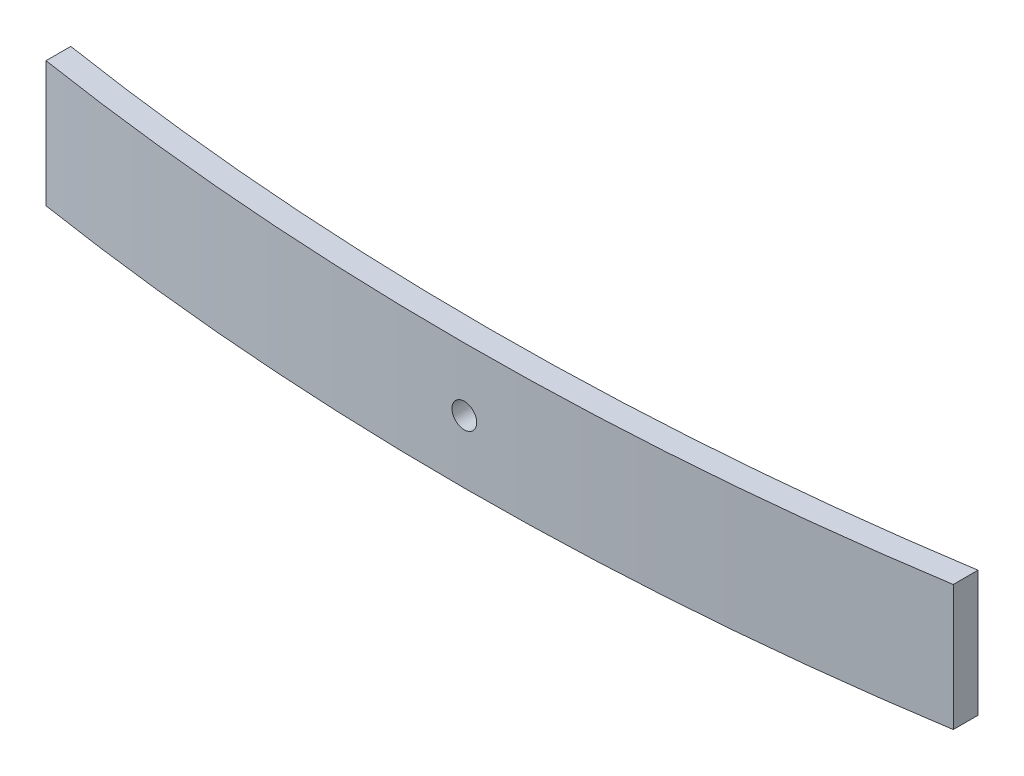
ISO-10303-21;
HEADER;
FILE_DESCRIPTION(('STEP AP214'),'2;1');
FILE_NAME('part.step','',(''),(''),'','','');
FILE_SCHEMA(('AUTOMOTIVE_DESIGN { 1 0 10303 214 1 1 1 1 }'));
ENDSEC;
DATA;
#1=APPLICATION_CONTEXT('core data for automotive mechanical design processes');
#2=APPLICATION_PROTOCOL_DEFINITION('international standard','automotive_design',2000,#1);
#3=PRODUCT_CONTEXT('',#1,'mechanical');
#4=PRODUCT('Part','Part','',(#3));
#5=PRODUCT_RELATED_PRODUCT_CATEGORY('part','',(#4));
#6=PRODUCT_DEFINITION_FORMATION('','',#4);
#7=PRODUCT_DEFINITION_CONTEXT('part definition',#1,'design');
#8=PRODUCT_DEFINITION('design','',#6,#7);
#9=PRODUCT_DEFINITION_SHAPE('','',#8);
#10=(LENGTH_UNIT() NAMED_UNIT(*) SI_UNIT(.MILLI.,.METRE.));
#11=(NAMED_UNIT(*) PLANE_ANGLE_UNIT() SI_UNIT($,.RADIAN.));
#12=(NAMED_UNIT(*) SI_UNIT($,.STERADIAN.) SOLID_ANGLE_UNIT());
#13=UNCERTAINTY_MEASURE_WITH_UNIT(LENGTH_MEASURE(1.E-05),#10,'distance_accuracy_value','');
#14=(GEOMETRIC_REPRESENTATION_CONTEXT(3) GLOBAL_UNCERTAINTY_ASSIGNED_CONTEXT((#13)) GLOBAL_UNIT_ASSIGNED_CONTEXT((#10,
#11,#12)) REPRESENTATION_CONTEXT('',''));
#15=CARTESIAN_POINT('',(0.,0.,0.));
#16=DIRECTION('',(0.,0.,1.));
#17=DIRECTION('',(1.,0.,0.));
#18=AXIS2_PLACEMENT_3D('',#15,#16,#17);
#19=CARTESIAN_POINT('',(1.39133536110259E-13,76.2,-1523.04997748715));
#20=DIRECTION('',(0.,-1.,0.));
#21=DIRECTION('',(0.,0.,-1.));
#22=AXIS2_PLACEMENT_3D('',#19,#20,#21);
#23=CYLINDRICAL_SURFACE('',#22,1776.04997748715);
#24=CARTESIAN_POINT('',(1.39133536110259E-13,0.,-1523.04997748715));
#25=DIRECTION('',(0.,1.,0.));
#26=DIRECTION('',(0.,0.,1.));
#27=AXIS2_PLACEMENT_3D('',#24,#25,#26);
#28=CIRCLE('',#27,1776.04997748715);
#29=CARTESIAN_POINT('',(275.021699517166,0.,231.577215772659));
#30=VERTEX_POINT('',#29);
#31=CARTESIAN_POINT('',(-275.021699517165,0.,231.57721577266));
#32=VERTEX_POINT('',#31);
#33=EDGE_CURVE('E122',#30,#32,#28,.F.);
#34=ORIENTED_EDGE('',*,*,#33,.F.);
#35=DIRECTION('',(0.,-1.,0.));
#36=VECTOR('',#35,1.);
#37=CARTESIAN_POINT('',(275.021699517166,76.2,231.577215772659));
#38=LINE('',#37,#36);
#39=CARTESIAN_POINT('',(275.021699517166,76.2,231.577215772659));
#40=VERTEX_POINT('',#39);
#41=EDGE_CURVE('E11',#40,#30,#38,.T.);
#42=ORIENTED_EDGE('',*,*,#41,.F.);
#43=CARTESIAN_POINT('',(1.39133536110259E-13,76.2,-1523.04997748715));
#44=DIRECTION('',(0.,1.,0.));
#45=DIRECTION('',(0.,0.,1.));
#46=AXIS2_PLACEMENT_3D('',#43,#44,#45);
#47=CIRCLE('',#46,1776.04997748715);
#48=CARTESIAN_POINT('',(-275.021699517165,76.2,231.57721577266));
#49=VERTEX_POINT('',#48);
#50=EDGE_CURVE('E115',#40,#49,#47,.F.);
#51=ORIENTED_EDGE('',*,*,#50,.T.);
#52=DIRECTION('',(0.,-1.,0.));
#53=VECTOR('',#52,1.);
#54=CARTESIAN_POINT('',(-275.021699517165,76.2,231.57721577266));
#55=LINE('',#54,#53);
#56=EDGE_CURVE('E94',#49,#32,#55,.T.);
#57=ORIENTED_EDGE('',*,*,#56,.T.);
#58=EDGE_LOOP('',(#34,#42,#51,#57));
#59=FACE_BOUND('',#58,.T.);
#60=CARTESIAN_POINT('',(1.39133536110259E-13,30.6,253.));
#61=CARTESIAN_POINT('',(-0.210713968094779,30.5999984867718,253.000000017793));
#62=CARTESIAN_POINT('',(-0.421403110930859,30.6088837241473,252.999962421728));
#63=CARTESIAN_POINT('',(-0.841354181845625,30.6443626478279,252.999813125687));
#64=CARTESIAN_POINT('',(-1.05061571988427,30.6709609920997,252.999701406219));
#65=CARTESIAN_POINT('',(-1.46633777348706,30.7417152082758,252.999406859924));
#66=CARTESIAN_POINT('',(-1.67279562512373,30.7858867143383,252.999223969782));
#67=CARTESIAN_POINT('',(-2.08132982906183,30.8914915499317,252.998792209094));
#68=CARTESIAN_POINT('',(-2.28340455125407,30.9529311869032,252.99854331444));
#69=CARTESIAN_POINT('',(-2.68152110119553,31.0925814227028,252.997986836868));
#70=CARTESIAN_POINT('',(-2.87756687230419,31.1707807807116,252.997679293301));
#71=CARTESIAN_POINT('',(-3.26237590887551,31.3434199132982,252.997014137911));
#72=CARTESIAN_POINT('',(-3.45113906456135,31.4378599325678,252.996656525334));
#73=CARTESIAN_POINT('',(-3.8199878049602,31.6422805388219,252.995901490769));
#74=CARTESIAN_POINT('',(-4.00007570143521,31.7522569546406,252.995504079474));
#75=CARTESIAN_POINT('',(-4.35035222525643,31.9869905222912,252.994680636078));
#76=CARTESIAN_POINT('',(-4.52054062300152,32.1117480167399,252.994254603313));
#77=CARTESIAN_POINT('',(-4.84979170206723,32.3751451316169,252.993386048449));
#78=CARTESIAN_POINT('',(-5.00885520931108,32.5137837196365,252.992943527577));
#79=CARTESIAN_POINT('',(-5.31479308067827,32.8040158599574,252.992054369382));
#80=CARTESIAN_POINT('',(-5.4616632047594,32.9556138817971,252.991607730686));
#81=CARTESIAN_POINT('',(-5.74206362701642,33.2705952098567,252.990723311728));
#82=CARTESIAN_POINT('',(-5.87559815641371,33.4339747494301,252.990285528692));
#83=CARTESIAN_POINT('',(-6.12847828337048,33.771463069239,252.989430939818));
#84=CARTESIAN_POINT('',(-6.24781862373922,33.9455757887633,252.989014141786));
#85=CARTESIAN_POINT('',(-6.47138111476852,34.3032005309573,252.988213616074));
#86=CARTESIAN_POINT('',(-6.57560639321551,34.4867105983519,252.987829881559));
#87=CARTESIAN_POINT('',(-6.76822875919972,34.8618615632207,252.98710627353));
#88=CARTESIAN_POINT('',(-6.85662560065947,35.053502587046,252.986766400699));
#89=CARTESIAN_POINT('',(-7.01695887812284,35.443546097178,252.986140178145));
#90=CARTESIAN_POINT('',(-7.08889566823635,35.641948437921,252.98585382727));
#91=CARTESIAN_POINT('',(-7.21580133308614,36.0441127387919,252.985342762279));
#92=CARTESIAN_POINT('',(-7.27076981084061,36.2478748241927,252.985118049605));
#93=CARTESIAN_POINT('',(-7.36333699178478,36.659266525497,252.984736685148));
#94=CARTESIAN_POINT('',(-7.40093897454985,36.8668954034653,252.984580020515));
#95=CARTESIAN_POINT('',(-7.45853120590771,37.2846549482945,252.984339094535));
#96=CARTESIAN_POINT('',(-7.47851535225071,37.4947864564643,252.984254858275));
#97=CARTESIAN_POINT('',(-7.50070359679291,37.9159102543572,252.984161289859));
#98=CARTESIAN_POINT('',(-7.50291408330494,38.1269022075304,252.98415193079));
#99=CARTESIAN_POINT('',(-7.48955360463755,38.5484004665782,252.984208322118));
#100=CARTESIAN_POINT('',(-7.47397607404443,38.7589065643844,252.984274100248));
#101=CARTESIAN_POINT('',(-7.42514452560689,39.1778160268164,252.984478922777));
#102=CARTESIAN_POINT('',(-7.39189401428338,39.386219800212,252.984617952642));
#103=CARTESIAN_POINT('',(-7.30795445093886,39.7994886750944,252.984965325868));
#104=CARTESIAN_POINT('',(-7.25726512758627,40.00435372147,252.985173670308));
#105=CARTESIAN_POINT('',(-7.13880941808651,40.4090816554473,252.985653753506));
#106=CARTESIAN_POINT('',(-7.07104334628323,40.6089446350512,252.985925491099));
#107=CARTESIAN_POINT('',(-6.91891409978093,41.0022558470402,252.986524655178));
#108=CARTESIAN_POINT('',(-6.83455053674627,41.1957039292107,252.986852082966));
#109=CARTESIAN_POINT('',(-6.64984230973388,41.5747716673122,252.987553267696));
#110=CARTESIAN_POINT('',(-6.54950055498256,41.7603927405778,252.9879270162));
#111=CARTESIAN_POINT('',(-6.33350673998434,42.1225834438659,252.988710406047));
#112=CARTESIAN_POINT('',(-6.2178493908565,42.2991499177425,252.989120059772));
#113=CARTESIAN_POINT('',(-5.97209494733969,42.6418601532707,252.98996341449));
#114=CARTESIAN_POINT('',(-5.84200303653208,42.8080076231484,252.990397106822));
#115=CARTESIAN_POINT('',(-5.56830511634727,43.1287715124287,252.991276344151));
#116=CARTESIAN_POINT('',(-5.42469413510149,43.2833836517498,252.991721893463));
#117=CARTESIAN_POINT('',(-4.97502421482192,43.7281685004763,252.993057195178));
#118=CARTESIAN_POINT('',(-4.6498630595049,43.9996590137956,252.993946551662));
#119=CARTESIAN_POINT('',(-4.13197567971227,44.3627081259288,252.995201923407));
#120=CARTESIAN_POINT('',(-3.95423770702111,44.4764002086073,252.99560743072));
#121=CARTESIAN_POINT('',(-3.58980904910957,44.6884506790732,252.996381434127));
#122=CARTESIAN_POINT('',(-3.4031181544951,44.7868087079934,252.996749929354));
#123=CARTESIAN_POINT('',(-2.83165300721099,45.0576661242204,252.997783327221));
#124=CARTESIAN_POINT('',(-2.43517114126737,45.2061693090257,252.998376934446));
#125=CARTESIAN_POINT('',(-1.62308827124561,45.434416916634,252.999304792558));
#126=CARTESIAN_POINT('',(-1.20748726904261,45.5141613461806,252.999639043471));
#127=CARTESIAN_POINT('',(-0.368800144783284,45.6027859953174,253.000011208188));
#128=CARTESIAN_POINT('',(0.0542859194178723,45.6116667624026,253.000049124283));
#129=CARTESIAN_POINT('',(0.896132618131259,45.5581931101371,252.999823726225));
#130=CARTESIAN_POINT('',(1.31489325255166,45.4958386892741,252.999560412068));
#131=CARTESIAN_POINT('',(1.93034367877394,45.350406625668,252.998962948761));
#132=CARTESIAN_POINT('',(2.13346696571783,45.2932419084602,252.998729895662));
#133=CARTESIAN_POINT('',(2.5341633176818,45.162045795966,252.998203357605));
#134=CARTESIAN_POINT('',(2.73173651249225,45.0880147954714,252.997909874061));
#135=CARTESIAN_POINT('',(3.31406084676334,44.8412313409882,252.996950242197));
#136=CARTESIAN_POINT('',(3.68878109502351,44.6437020734127,252.996204537467));
#137=CARTESIAN_POINT('',(4.22148178855395,44.302730393453,252.994991984489));
#138=CARTESIAN_POINT('',(4.39423732139201,44.1815494254651,252.99457188216));
#139=CARTESIAN_POINT('',(4.72893486876265,43.9250760102938,252.993712173886));
#140=CARTESIAN_POINT('',(4.89088085068094,43.7897887877032,252.993272575197));
#141=CARTESIAN_POINT('',(5.2028389741049,43.5060131269225,252.992386135608));
#142=CARTESIAN_POINT('',(5.35284682055937,43.357519977882,252.991939292171));
#143=CARTESIAN_POINT('',(5.63977310900407,43.0484737070593,252.99105133538));
#144=CARTESIAN_POINT('',(5.77669606337011,42.8879247771161,252.990610220097));
#145=CARTESIAN_POINT('',(6.03655633591687,42.5558335361281,252.989746002998));
#146=CARTESIAN_POINT('',(6.15949097179768,42.3842891264945,252.989322904648));
#147=CARTESIAN_POINT('',(6.39046942201545,42.0314575902559,252.98850682996));
#148=CARTESIAN_POINT('',(6.49851358458272,41.8501706916277,252.988113852918));
#149=CARTESIAN_POINT('',(6.69894774113214,41.4791360457968,252.987369158747));
#150=CARTESIAN_POINT('',(6.79133744698067,41.2893881429433,252.987017442377));
#151=CARTESIAN_POINT('',(6.9598022124246,40.9027865931224,252.986365267457));
#152=CARTESIAN_POINT('',(7.0358775259389,40.7059330568036,252.986064808109));
#153=CARTESIAN_POINT('',(7.17118720449925,40.3064792017955,252.985523618733));
#154=CARTESIAN_POINT('',(7.23041839084983,40.1038778063368,252.985282899979));
#155=CARTESIAN_POINT('',(7.33158072491748,39.6944803968452,252.984868177991));
#156=CARTESIAN_POINT('',(7.37351824975525,39.4876859585833,252.984694150165));
#157=CARTESIAN_POINT('',(7.43983858987241,39.0712246263159,252.984417572837));
#158=CARTESIAN_POINT('',(7.46421508897784,38.861556726414,252.984315049055));
#159=CARTESIAN_POINT('',(7.4952100559816,38.4409854893941,252.984184515178));
#160=CARTESIAN_POINT('',(7.50183466739309,38.2300826050054,252.984156479306));
#161=CARTESIAN_POINT('',(7.49729604901426,37.8084313167287,252.984175644233));
#162=CARTESIAN_POINT('',(7.48612970385174,37.5976829463633,252.984222858209));
#163=CARTESIAN_POINT('',(7.44608319144542,37.177881007496,252.984391205324));
#164=CARTESIAN_POINT('',(7.41720343879284,36.9688273994434,252.984512336734));
#165=CARTESIAN_POINT('',(7.34193498439913,36.5538917028773,252.984825082016));
#166=CARTESIAN_POINT('',(7.29554590651513,36.3480096825963,252.985016697403));
#167=CARTESIAN_POINT('',(7.18558954382425,35.9408886735016,252.985464967259));
#168=CARTESIAN_POINT('',(7.12202252604789,35.7396496125661,252.985721620717));
#169=CARTESIAN_POINT('',(6.97814667319727,35.3431999543689,252.986292743016));
#170=CARTESIAN_POINT('',(6.8978343085854,35.1479906380153,252.986607224044));
#171=CARTESIAN_POINT('',(6.72107980430757,34.7651040508117,252.987284909401));
#172=CARTESIAN_POINT('',(6.62464362886644,34.5774240265767,252.987648095704));
#173=CARTESIAN_POINT('',(6.41627290528498,34.2107950839366,252.988413096412));
#174=CARTESIAN_POINT('',(6.30433343128883,34.0318489650874,252.988814923083));
#175=CARTESIAN_POINT('',(6.06581689289909,33.6840847361217,252.989645553125));
#176=CARTESIAN_POINT('',(5.93924490882263,33.5152631415665,252.990074347111));
#177=CARTESIAN_POINT('',(5.672319918689,33.1888660580893,252.990946907972));
#178=CARTESIAN_POINT('',(5.53196570521891,33.0312915565777,252.991390676157));
#179=CARTESIAN_POINT('',(5.23848659589204,32.7285285010307,252.992280544971));
#180=CARTESIAN_POINT('',(5.08536199605346,32.5833396600527,252.992726645546));
#181=CARTESIAN_POINT('',(4.76738488124473,32.3063385507568,252.993608647806));
#182=CARTESIAN_POINT('',(4.60252923302693,32.1745298791337,252.994044546725));
#183=CARTESIAN_POINT('',(4.26230143452238,31.9252727160435,252.994893638276));
#184=CARTESIAN_POINT('',(4.08692944268899,31.8078240082909,252.995306831249));
#185=CARTESIAN_POINT('',(3.72679224644604,31.5880456665329,252.996099052417));
#186=CARTESIAN_POINT('',(3.54202080718429,31.4857262486,252.996478057458));
#187=CARTESIAN_POINT('',(3.16457932589505,31.297064106327,252.997190684133));
#188=CARTESIAN_POINT('',(2.97191219636436,31.2107155544446,252.997524322307));
#189=CARTESIAN_POINT('',(2.58015719959564,31.0546324777027,252.998136625653));
#190=CARTESIAN_POINT('',(2.38107520557347,30.984883219795,252.998415339535));
#191=CARTESIAN_POINT('',(1.97781144430167,30.8624129523238,252.998910200255));
#192=CARTESIAN_POINT('',(1.77363103212912,30.8096874689385,252.999126363529));
#193=CARTESIAN_POINT('',(1.31020489979042,30.7106430274461,252.999535351372));
#194=CARTESIAN_POINT('',(1.04990557260771,30.6691871109607,252.99970896714));
#195=CARTESIAN_POINT('',(0.526391255000497,30.6138665423076,252.999941280342));
#196=CARTESIAN_POINT('',(0.263176264592619,30.6000018899827,252.999999977777));
#197=CARTESIAN_POINT('',(1.39133536110259E-13,30.6,253.));
#198=B_SPLINE_CURVE_WITH_KNOTS('',3,(#60,#61,#62,#63,#64,#65,#66,#67,#68,#69,#70,#71,#72,#73,
#74,#75,#76,#77,#78,#79,#80,#81,#82,#83,#84,#85,#86,#87,#88,#89,#90,#91,#92,#93,#94,#95,#96,#97,
#98,#99,#100,#101,#102,#103,#104,#105,#106,#107,#108,#109,#110,#111,#112,#113,#114,#115,#116,
#117,#118,#119,#120,#121,#122,#123,#124,#125,#126,#127,#128,#129,#130,#131,#132,#133,#134,#135,
#136,#137,#138,#139,#140,#141,#142,#143,#144,#145,#146,#147,#148,#149,#150,#151,#152,#153,#154,
#155,#156,#157,#158,#159,#160,#161,#162,#163,#164,#165,#166,#167,#168,#169,#170,#171,#172,#173,
#174,#175,#176,#177,#178,#179,#180,#181,#182,#183,#184,#185,#186,#187,#188,#189,#190,#191,#192,
#193,#194,#195,#196,#197),.UNSPECIFIED.,.T.,.F.,(4,2,2,2,2,2,2,2,2,2,2,2,2,2,2,2,2,2,2,2,2,2,2,
2,2,2,2,2,2,2,2,2,2,2,2,2,2,2,2,2,2,2,2,2,2,2,2,2,2,2,2,2,2,2,2,2,2,2,2,2,2,2,2,2,2,2,2,2,4),
(0.,0.631912024301777,1.2639902864152,1.89663214600144,2.52950538839113,3.16195548087539,
3.79441510307562,4.4267052459563,5.05901004782971,5.69126785680884,6.32374460980309,
6.95602004377835,7.58852893310258,8.22090674891289,8.85329439515874,9.48566843538515,
10.1180572691842,10.7503266306474,11.3828149038618,12.0150758342728,12.6475702025455,
13.2799391235442,13.9123178840565,14.5446850047721,15.177066922899,15.8093338315781,
16.4418196509556,17.0740790696136,17.7065719276866,18.9702098092056,19.602583667419,
20.2349723230349,21.4986105469059,22.7622486468442,24.0258769838608,25.2895053477042,
25.9218869189979,26.5542536895501,27.8178774792359,28.450372115571,29.0826333187677,
29.7151209754032,30.3473897231102,30.9797795065627,31.6121544983652,32.2445411283047,
32.8769179149983,33.5094139599539,34.1416765599364,34.7741664524213,35.4064374266601,
36.0388191299599,36.6711860326123,37.3035665208154,37.9359371792494,38.5684412619989,
39.2007118959496,39.8331838838019,40.4654369370645,41.097745429307,41.7300392686787,
42.3625026260201,42.9949564562123,43.6278354202829,44.2604829982539,44.892566944869,
45.5244846453389,46.3137263294984,47.1029680091572),.UNSPECIFIED.);
#199=CARTESIAN_POINT('',(1.39133536110259E-13,30.6,253.));
#200=VERTEX_POINT('',#199);
#201=EDGE_CURVE('E125',#200,#200,#198,.T.);
#202=ORIENTED_EDGE('',*,*,#201,.T.);
#203=EDGE_LOOP('',(#202));
#204=FACE_BOUND('',#203,.T.);
#205=ADVANCED_FACE('F49',(#59,#204),#23,.T.);
#206=CARTESIAN_POINT('',(1.7338276579252E-13,76.2,-1538.04997748712));
#207=DIRECTION('',(0.,-1.,0.));
#208=DIRECTION('',(0.,0.,-1.));
#209=AXIS2_PLACEMENT_3D('',#206,#207,#208);
#210=CYLINDRICAL_SURFACE('',#209,1776.04997748712);
#211=CARTESIAN_POINT('',(1.7338276579252E-13,0.,-1538.04997748712));
#212=DIRECTION('',(0.,1.,0.));
#213=DIRECTION('',(0.,0.,1.));
#214=AXIS2_PLACEMENT_3D('',#211,#212,#213);
#215=CIRCLE('',#214,1776.04997748712);
#216=CARTESIAN_POINT('',(275.021699517166,0.,216.57721577266));
#217=VERTEX_POINT('',#216);
#218=CARTESIAN_POINT('',(-275.021699517165,0.,216.57721577266));
#219=VERTEX_POINT('',#218);
#220=EDGE_CURVE('E87',#217,#219,#215,.F.);
#221=ORIENTED_EDGE('',*,*,#220,.T.);
#222=DIRECTION('',(0.,-1.,0.));
#223=VECTOR('',#222,1.);
#224=CARTESIAN_POINT('',(-275.021699517165,76.2,216.57721577266));
#225=LINE('',#224,#223);
#226=CARTESIAN_POINT('',(-275.021699517165,76.2,216.57721577266));
#227=VERTEX_POINT('',#226);
#228=EDGE_CURVE('E108',#227,#219,#225,.T.);
#229=ORIENTED_EDGE('',*,*,#228,.F.);
#230=CARTESIAN_POINT('',(1.7338276579252E-13,76.2,-1538.04997748712));
#231=DIRECTION('',(0.,1.,0.));
#232=DIRECTION('',(0.,0.,1.));
#233=AXIS2_PLACEMENT_3D('',#230,#231,#232);
#234=CIRCLE('',#233,1776.04997748712);
#235=CARTESIAN_POINT('',(275.021699517166,76.2,216.57721577266));
#236=VERTEX_POINT('',#235);
#237=EDGE_CURVE('E110',#236,#227,#234,.F.);
#238=ORIENTED_EDGE('',*,*,#237,.F.);
#239=DIRECTION('',(0.,-1.,0.));
#240=VECTOR('',#239,1.);
#241=CARTESIAN_POINT('',(275.021699517166,76.2,216.57721577266));
#242=LINE('',#241,#240);
#243=EDGE_CURVE('E64',#236,#217,#242,.T.);
#244=ORIENTED_EDGE('',*,*,#243,.T.);
#245=EDGE_LOOP('',(#221,#229,#238,#244));
#246=FACE_BOUND('',#245,.T.);
#247=CARTESIAN_POINT('',(-7.5,38.1,237.984164226377));
#248=CARTESIAN_POINT('',(-7.50000151322819,38.3107139680855,237.984164208571));
#249=CARTESIAN_POINT('',(-7.49111627585349,38.5214031109122,237.984201804954));
#250=CARTESIAN_POINT('',(-7.45563735217615,38.9413541818078,237.984351102375));
#251=CARTESIAN_POINT('',(-7.42903900790671,39.1506157198367,237.984462822905));
#252=CARTESIAN_POINT('',(-7.35828479173724,39.56633777342,237.984757371678));
#253=CARTESIAN_POINT('',(-7.31411328567894,39.7727956250468,237.984940263235));
#254=CARTESIAN_POINT('',(-7.208508450096,40.181329828965,237.985372027225));
#255=CARTESIAN_POINT('',(-7.14706881313061,40.3834045511471,237.985620923765));
#256=CARTESIAN_POINT('',(-7.00741857734594,40.781521101067,237.986177405229));
#257=CARTESIAN_POINT('',(-6.92921921934607,40.9775668721644,237.986484950801));
#258=CARTESIAN_POINT('',(-6.75658008677935,41.362375908714,237.987150110131));
#259=CARTESIAN_POINT('',(-6.66214006752074,41.5511390643896,237.987507724643));
#260=CARTESIAN_POINT('',(-6.45771946129041,41.9199878047696,237.988262762776));
#261=CARTESIAN_POINT('',(-6.34774304548433,42.1000757012362,237.988660175705));
#262=CARTESIAN_POINT('',(-6.11300947786033,42.4503522250429,237.989483621892));
#263=CARTESIAN_POINT('',(-5.98825198342546,42.6205406227819,237.989909655813));
#264=CARTESIAN_POINT('',(-5.72485486856214,42.9497917018563,237.990778212374));
#265=CARTESIAN_POINT('',(-5.58621628054089,43.1088552091137,237.991220733785));
#266=CARTESIAN_POINT('',(-5.29598414021393,43.4147930805081,237.992109892412));
#267=CARTESIAN_POINT('',(-5.14438611836974,43.5616632046028,237.992556531002));
#268=CARTESIAN_POINT('',(-4.82940479029845,43.8420636268864,237.993440949047));
#269=CARTESIAN_POINT('',(-4.66602525071787,43.9755981562967,237.993878731277));
#270=CARTESIAN_POINT('',(-4.32853693089197,44.2284782832785,237.994733317996));
#271=CARTESIAN_POINT('',(-4.15442421135789,44.3478186236592,237.99515011468));
#272=CARTESIAN_POINT('',(-3.79679946915635,44.5713811147018,237.995950637267));
#273=CARTESIAN_POINT('',(-3.61328940176485,44.6756063931513,237.996334370007));
#274=CARTESIAN_POINT('',(-3.23813843690194,44.868228759141,237.997057974284));
#275=CARTESIAN_POINT('',(-3.04649741307953,44.9566256006036,237.997397845139));
#276=CARTESIAN_POINT('',(-2.65645390295346,45.116958878073,237.998024063724));
#277=CARTESIAN_POINT('',(-2.4580515622135,45.1888956681897,237.998310412606));
#278=CARTESIAN_POINT('',(-2.05588726134913,45.3158013330459,237.998821473857));
#279=CARTESIAN_POINT('',(-1.85212517595196,45.3707698108037,237.999046184785));
#280=CARTESIAN_POINT('',(-1.44073347465677,45.4633369917546,237.999427546169));
#281=CARTESIAN_POINT('',(-1.23310459669403,45.5009389745232,237.999584209475));
#282=CARTESIAN_POINT('',(-0.815345051876457,45.5585312058889,237.999825133397));
#283=CARTESIAN_POINT('',(-0.605213543712586,45.5785153522362,237.999909368927));
#284=CARTESIAN_POINT('',(-0.184089745831482,45.6007035967881,238.000002936514));
#285=CARTESIAN_POINT('',(0.0269022073360952,45.6029140833055,238.000012295484));
#286=CARTESIAN_POINT('',(0.448400466373141,45.5895536046497,237.999955904647));
#287=CARTESIAN_POINT('',(0.658906564174371,45.5739760740628,237.999890127108));
#288=CARTESIAN_POINT('',(1.07781602663256,45.5251445256344,237.999685306357));
#289=CARTESIAN_POINT('',(1.28621980005893,45.4918940143109,237.999546277678));
#290=CARTESIAN_POINT('',(1.69948867500321,45.407954450961,237.999198907313));
#291=CARTESIAN_POINT('',(1.90435372140975,45.357265127603,237.998990564548));
#292=CARTESIAN_POINT('',(2.30908165544806,45.2388094180872,237.998510484954));
#293=CARTESIAN_POINT('',(2.50894463508202,45.1710433462732,237.998238749291));
#294=CARTESIAN_POINT('',(2.90225584712975,45.0189140997444,237.997639589154));
#295=CARTESIAN_POINT('',(3.09570392932878,44.9345505366938,237.997312163378));
#296=CARTESIAN_POINT('',(3.474771667466,44.7498423096539,237.996610982501));
#297=CARTESIAN_POINT('',(3.6603927407395,44.6495005548925,237.996237235837));
#298=CARTESIAN_POINT('',(4.02258344404181,44.433506739873,237.995453849319));
#299=CARTESIAN_POINT('',(4.1991499179246,44.3178493907339,237.995044197083));
#300=CARTESIAN_POINT('',(4.5418601534629,44.0720949471939,237.994200844778));
#301=CARTESIAN_POINT('',(4.70800762334451,43.9420030363744,237.993767153369));
#302=CARTESIAN_POINT('',(5.02877151263007,43.6683051161658,237.992887917265));
#303=CARTESIAN_POINT('',(5.18338365195258,43.524694134908,237.992442368252));
#304=CARTESIAN_POINT('',(5.62816850065028,43.075024214623,237.991107066408));
#305=CARTESIAN_POINT('',(5.89965901394052,42.7498630593184,237.990217708469));
#306=CARTESIAN_POINT('',(6.26270812603403,42.231975679552,237.988962332907));
#307=CARTESIAN_POINT('',(6.37640020870004,42.0542377068708,237.988556824049));
#308=CARTESIAN_POINT('',(6.58845067914274,41.689809048981,237.987782817221));
#309=CARTESIAN_POINT('',(6.68680870805227,41.5031181543784,237.987414320118));
#310=CARTESIAN_POINT('',(6.95766612427186,40.9316530070874,237.986380916429));
#311=CARTESIAN_POINT('',(7.10616930907641,40.5351711411231,237.985787305057));
#312=CARTESIAN_POINT('',(7.33441691667697,39.7230882710565,237.98485943989));
#313=CARTESIAN_POINT('',(7.4141613462167,39.3074872688294,237.984525186069));
#314=CARTESIAN_POINT('',(7.50278599532745,38.4688001445599,237.98415301811));
#315=CARTESIAN_POINT('',(7.51166676240022,38.0457140803734,237.984115101681));
#316=CARTESIAN_POINT('',(7.45819311011506,37.2038673816924,237.984340501733));
#317=CARTESIAN_POINT('',(7.39583868924482,36.7851067472898,237.984603818221));
#318=CARTESIAN_POINT('',(7.25040662563846,36.1696563211186,237.985201286274));
#319=CARTESIAN_POINT('',(7.19324190843678,35.9665330342062,237.985434341165));
#320=CARTESIAN_POINT('',(7.06204579596008,35.5658366823044,237.98596088302));
#321=CARTESIAN_POINT('',(6.988014795477,35.3682634875246,237.986254368569));
#322=CARTESIAN_POINT('',(6.74123134103598,34.7859391533421,237.987214006388));
#323=CARTESIAN_POINT('',(6.54370207349932,34.4112189051374,237.987959715012));
#324=CARTESIAN_POINT('',(6.20273039359089,33.8785182116486,237.989172272509));
#325=CARTESIAN_POINT('',(6.08154942560717,33.7057626788045,237.989592376125));
#326=CARTESIAN_POINT('',(5.82507601044283,33.3710651314208,237.990452086403));
#327=CARTESIAN_POINT('',(5.68978878785503,33.2091191494955,237.990891685811));
#328=CARTESIAN_POINT('',(5.40601312707813,32.8971610260567,237.991778126146));
#329=CARTESIAN_POINT('',(5.25751997803879,32.7471531795944,237.99222496961));
#330=CARTESIAN_POINT('',(4.9484737072162,32.4602268911334,237.993112925805));
#331=CARTESIAN_POINT('',(4.78792477727201,32.3233039367589,237.993554040465));
#332=CARTESIAN_POINT('',(4.45583353628018,32.0634436641952,237.99441825571));
#333=CARTESIAN_POINT('',(4.28428912664368,31.9405090283058,237.994841352831));
#334=CARTESIAN_POINT('',(3.9314575903977,31.7095305780715,237.995657424617));
#335=CARTESIAN_POINT('',(3.75017069176504,31.6014864154963,237.996050399988));
#336=CARTESIAN_POINT('',(3.37913604592411,31.4010522589318,237.99679509052));
#337=CARTESIAN_POINT('',(3.18938814306502,31.3086625530763,237.997146804922));
#338=CARTESIAN_POINT('',(2.80278659323258,31.1401977876195,237.997798975874));
#339=CARTESIAN_POINT('',(2.60593305690778,31.0641224740995,237.998099433221));
#340=CARTESIAN_POINT('',(2.20647920190445,30.9288127955346,237.998640618766));
#341=CARTESIAN_POINT('',(2.00387780645707,30.8695816091838,237.998881335687));
#342=CARTESIAN_POINT('',(1.59448039698904,30.7684192751141,237.999296054414));
#343=CARTESIAN_POINT('',(1.38768595873947,30.7264817502745,237.99947008081));
#344=CARTESIAN_POINT('',(0.971224626496974,30.6601614101516,237.999746655793));
#345=CARTESIAN_POINT('',(0.761556726607794,30.6357849110423,237.999849178662));
#346=CARTESIAN_POINT('',(0.340985489613201,30.6047899440287,237.999979711377));
#347=CARTESIAN_POINT('',(0.130082605237176,30.5981653326113,238.000007747002));
#348=CARTESIAN_POINT('',(-0.291568683048708,30.6027039509765,237.999988582246));
#349=CARTESIAN_POINT('',(-0.502317053436068,30.6138702961342,237.99994136869));
#350=CARTESIAN_POINT('',(-0.922118992347891,30.6539168085346,237.999773023056));
#351=CARTESIAN_POINT('',(-1.13117260042309,30.6827965611862,237.99965189271));
#352=CARTESIAN_POINT('',(-1.54610829703443,30.7580650155817,237.999339150038));
#353=CARTESIAN_POINT('',(-1.75199031733827,30.8044540934685,237.999147536199));
#354=CARTESIAN_POINT('',(-2.15911132647842,30.9144104561691,237.998699269789));
#355=CARTESIAN_POINT('',(-2.36035038743662,30.9779774739523,237.998442618228));
#356=CARTESIAN_POINT('',(-2.75680004567823,31.1218533268206,237.997871499833));
#357=CARTESIAN_POINT('',(-2.95200936205343,31.2021656914433,237.997557020813));
#358=CARTESIAN_POINT('',(-3.33489594929877,31.3789201957465,237.99687933939));
#359=CARTESIAN_POINT('',(-3.52257597355381,31.4753563712022,237.996516155013));
#360=CARTESIAN_POINT('',(-3.88920491623114,31.6837270948159,237.995751157795));
#361=CARTESIAN_POINT('',(-4.06815103509762,31.7956665688298,237.995349332688));
#362=CARTESIAN_POINT('',(-4.41591526409443,32.0341831072574,237.994518705298));
#363=CARTESIAN_POINT('',(-4.58473685866347,32.1607550913541,237.994089912401));
#364=CARTESIAN_POINT('',(-4.9111339421384,32.4276800815086,237.993217353088));
#365=CARTESIAN_POINT('',(-5.06870844363561,32.568034294977,237.992773585361));
#366=CARTESIAN_POINT('',(-5.37147149915389,32.8615134042977,237.991883716795));
#367=CARTESIAN_POINT('',(-5.51666034011747,33.0146380041317,237.991437616008));
#368=CARTESIAN_POINT('',(-5.79366144938522,33.3326151189285,237.990555612669));
#369=CARTESIAN_POINT('',(-5.9254701209946,33.4974707671389,237.990119712883));
#370=CARTESIAN_POINT('',(-6.17472728405848,33.8376985656261,237.989270619054));
#371=CARTESIAN_POINT('',(-6.29217599179849,34.0130705574495,237.988857424669));
#372=CARTESIAN_POINT('',(-6.51195433354262,34.3732077536857,237.988065200254));
#373=CARTESIAN_POINT('',(-6.61427375147285,34.5579791929515,237.987686193376));
#374=CARTESIAN_POINT('',(-6.80293589374009,34.935420674249,237.986973562954));
#375=CARTESIAN_POINT('',(-6.88928444561939,35.1280878037838,237.986639922868));
#376=CARTESIAN_POINT('',(-7.04536752235469,35.5198428005607,237.986027615559));
#377=CARTESIAN_POINT('',(-7.11511678025875,35.7189247945869,237.985748899626));
#378=CARTESIAN_POINT('',(-7.23758704772251,36.1221885558675,237.985254035171));
#379=CARTESIAN_POINT('',(-7.29031253110392,36.3263689680447,237.985037870214));
#380=CARTESIAN_POINT('',(-7.38935697257925,36.789795100359,237.984628879072));
#381=CARTESIAN_POINT('',(-7.43081288905515,37.050094427512,237.98445526181));
#382=CARTESIAN_POINT('',(-7.48613345769553,37.5736087450595,237.984222946583));
#383=CARTESIAN_POINT('',(-7.49999811001735,37.8368237354374,237.984164248616));
#384=CARTESIAN_POINT('',(-7.5,38.1,237.984164226377));
#385=B_SPLINE_CURVE_WITH_KNOTS('',3,(#247,#248,#249,#250,#251,#252,#253,#254,#255,#256,#257,
#258,#259,#260,#261,#262,#263,#264,#265,#266,#267,#268,#269,#270,#271,#272,#273,#274,#275,#276,
#277,#278,#279,#280,#281,#282,#283,#284,#285,#286,#287,#288,#289,#290,#291,#292,#293,#294,#295,
#296,#297,#298,#299,#300,#301,#302,#303,#304,#305,#306,#307,#308,#309,#310,#311,#312,#313,#314,
#315,#316,#317,#318,#319,#320,#321,#322,#323,#324,#325,#326,#327,#328,#329,#330,#331,#332,#333,
#334,#335,#336,#337,#338,#339,#340,#341,#342,#343,#344,#345,#346,#347,#348,#349,#350,#351,#352,
#353,#354,#355,#356,#357,#358,#359,#360,#361,#362,#363,#364,#365,#366,#367,#368,#369,#370,#371,
#372,#373,#374,#375,#376,#377,#378,#379,#380,#381,#382,#383,#384),.UNSPECIFIED.,.T.,.F.,(4,2,2,
2,2,2,2,2,2,2,2,2,2,2,2,2,2,2,2,2,2,2,2,2,2,2,2,2,2,2,2,2,2,2,2,2,2,2,2,2,2,2,2,2,2,2,2,2,2,2,2,
2,2,2,2,2,2,2,2,2,2,2,2,2,2,2,2,2,4),(0.,0.631912024273445,1.26399028635864,1.89663214591711,
2.52950538827904,3.16195548073079,3.79441510289857,4.42670524574721,5.05901004758862,
5.69126785660492,6.32374460963637,6.95602004364789,7.58852893300835,8.22090674880479,
8.85329439503678,9.48566843524988,10.1180572690357,10.7503266304816,11.3828149036786,
12.015075834073,12.6475702023291,13.2799391234167,13.9123178840178,14.5446850048214,
15.1770669230362,15.8093338317406,16.4418196511433,17.0740790698267,17.7065719279251,
18.9702098093707,19.6025836675478,20.2349723231275,21.4986105470723,22.7622486470823,
24.0258769840529,25.2895053478503,25.9218869190543,26.554253689517,27.8178774790259,
28.4503721153762,29.0826333185882,29.7151209752384,30.3473897229599,30.9797795064268,
31.6121544982437,32.2445411281974,32.8769179149054,33.5094139598227,34.1416765597669,
34.7741664522143,35.4064374264159,36.0388191297804,36.6711860324975,37.3035665207648,
37.9359371792628,38.5684412620756,39.2007118960894,39.8331838840045,40.4654369373298,
41.0977454295341,41.7300392688676,42.3625026261715,42.9949564563263,43.6278354204137,
44.2604829984014,44.8925669450324,45.5244846455181,46.313726329588,47.1029680091571),.UNSPECIFIED.);
#386=CARTESIAN_POINT('',(-7.5,38.1,237.984164226377));
#387=VERTEX_POINT('',#386);
#388=EDGE_CURVE('E53',#387,#387,#385,.T.);
#389=ORIENTED_EDGE('',*,*,#388,.F.);
#390=EDGE_LOOP('',(#389));
#391=FACE_BOUND('',#390,.T.);
#392=ADVANCED_FACE('F111',(#246,#391),#210,.F.);
#393=CARTESIAN_POINT('',(275.021699517165,76.2,-1.017784743585E-12));
#394=DIRECTION('',(1.,0.,0.));
#395=DIRECTION('',(0.,0.,-1.));
#396=AXIS2_PLACEMENT_3D('',#393,#394,#395);
#397=PLANE('',#396);
#398=DIRECTION('',(0.,0.,1.));
#399=VECTOR('',#398,1.);
#400=CARTESIAN_POINT('',(275.021699517165,0.,-1.017784743585E-12));
#401=LINE('',#400,#399);
#402=EDGE_CURVE('E107',#217,#30,#401,.T.);
#403=ORIENTED_EDGE('',*,*,#402,.F.);
#404=ORIENTED_EDGE('',*,*,#243,.F.);
#405=DIRECTION('',(0.,0.,1.));
#406=VECTOR('',#405,1.);
#407=CARTESIAN_POINT('',(275.021699517165,76.2,-1.017784743585E-12));
#408=LINE('',#407,#406);
#409=EDGE_CURVE('E105',#236,#40,#408,.T.);
#410=ORIENTED_EDGE('',*,*,#409,.T.);
#411=ORIENTED_EDGE('',*,*,#41,.T.);
#412=EDGE_LOOP('',(#403,#404,#410,#411));
#413=FACE_BOUND('',#412,.T.);
#414=ADVANCED_FACE('F103',(#413),#397,.T.);
#415=CARTESIAN_POINT('',(-275.021699517165,76.2,0.));
#416=DIRECTION('',(1.,0.,0.));
#417=DIRECTION('',(0.,0.,-1.));
#418=AXIS2_PLACEMENT_3D('',#415,#416,#417);
#419=PLANE('',#418);
#420=DIRECTION('',(0.,0.,1.));
#421=VECTOR('',#420,1.);
#422=CARTESIAN_POINT('',(-275.021699517165,0.,0.));
#423=LINE('',#422,#421);
#424=EDGE_CURVE('E117',#219,#32,#423,.T.);
#425=ORIENTED_EDGE('',*,*,#424,.T.);
#426=ORIENTED_EDGE('',*,*,#56,.F.);
#427=DIRECTION('',(0.,0.,1.));
#428=VECTOR('',#427,1.);
#429=CARTESIAN_POINT('',(-275.021699517165,76.2,0.));
#430=LINE('',#429,#428);
#431=EDGE_CURVE('E72',#227,#49,#430,.T.);
#432=ORIENTED_EDGE('',*,*,#431,.F.);
#433=ORIENTED_EDGE('',*,*,#228,.T.);
#434=EDGE_LOOP('',(#425,#426,#432,#433));
#435=FACE_BOUND('',#434,.T.);
#436=ADVANCED_FACE('F132',(#435),#419,.F.);
#437=CARTESIAN_POINT('',(0.,76.2,0.));
#438=DIRECTION('',(0.,1.,0.));
#439=DIRECTION('',(0.,0.,1.));
#440=AXIS2_PLACEMENT_3D('',#437,#438,#439);
#441=PLANE('',#440);
#442=ORIENTED_EDGE('',*,*,#50,.F.);
#443=ORIENTED_EDGE('',*,*,#409,.F.);
#444=ORIENTED_EDGE('',*,*,#237,.T.);
#445=ORIENTED_EDGE('',*,*,#431,.T.);
#446=EDGE_LOOP('',(#442,#443,#444,#445));
#447=FACE_BOUND('',#446,.T.);
#448=ADVANCED_FACE('F114',(#447),#441,.T.);
#449=CARTESIAN_POINT('',(0.,0.,0.));
#450=DIRECTION('',(0.,1.,0.));
#451=DIRECTION('',(0.,0.,1.));
#452=AXIS2_PLACEMENT_3D('',#449,#450,#451);
#453=PLANE('',#452);
#454=ORIENTED_EDGE('',*,*,#33,.T.);
#455=ORIENTED_EDGE('',*,*,#424,.F.);
#456=ORIENTED_EDGE('',*,*,#220,.F.);
#457=ORIENTED_EDGE('',*,*,#402,.T.);
#458=EDGE_LOOP('',(#454,#455,#456,#457));
#459=FACE_BOUND('',#458,.T.);
#460=ADVANCED_FACE('F134',(#459),#453,.F.);
#461=CARTESIAN_POINT('',(0.,38.1,253.));
#462=DIRECTION('',(0.,0.,-1.));
#463=DIRECTION('',(-1.,0.,0.));
#464=AXIS2_PLACEMENT_3D('',#461,#462,#463);
#465=CYLINDRICAL_SURFACE('',#464,7.5);
#466=ORIENTED_EDGE('',*,*,#201,.F.);
#467=EDGE_LOOP('',(#466));
#468=FACE_BOUND('',#467,.T.);
#469=ORIENTED_EDGE('',*,*,#388,.T.);
#470=EDGE_LOOP('',(#469));
#471=FACE_BOUND('',#470,.T.);
#472=ADVANCED_FACE('F144',(#468,#471),#465,.F.);
#473=CLOSED_SHELL('',(#205,#392,#414,#436,#448,#460,#472));
#474=MANIFOLD_SOLID_BREP('B2',#473);
#475=ADVANCED_BREP_SHAPE_REPRESENTATION('',(#18,#474),#14);
#476=SHAPE_DEFINITION_REPRESENTATION(#9,#475);
ENDSEC;
END-ISO-10303-21;
